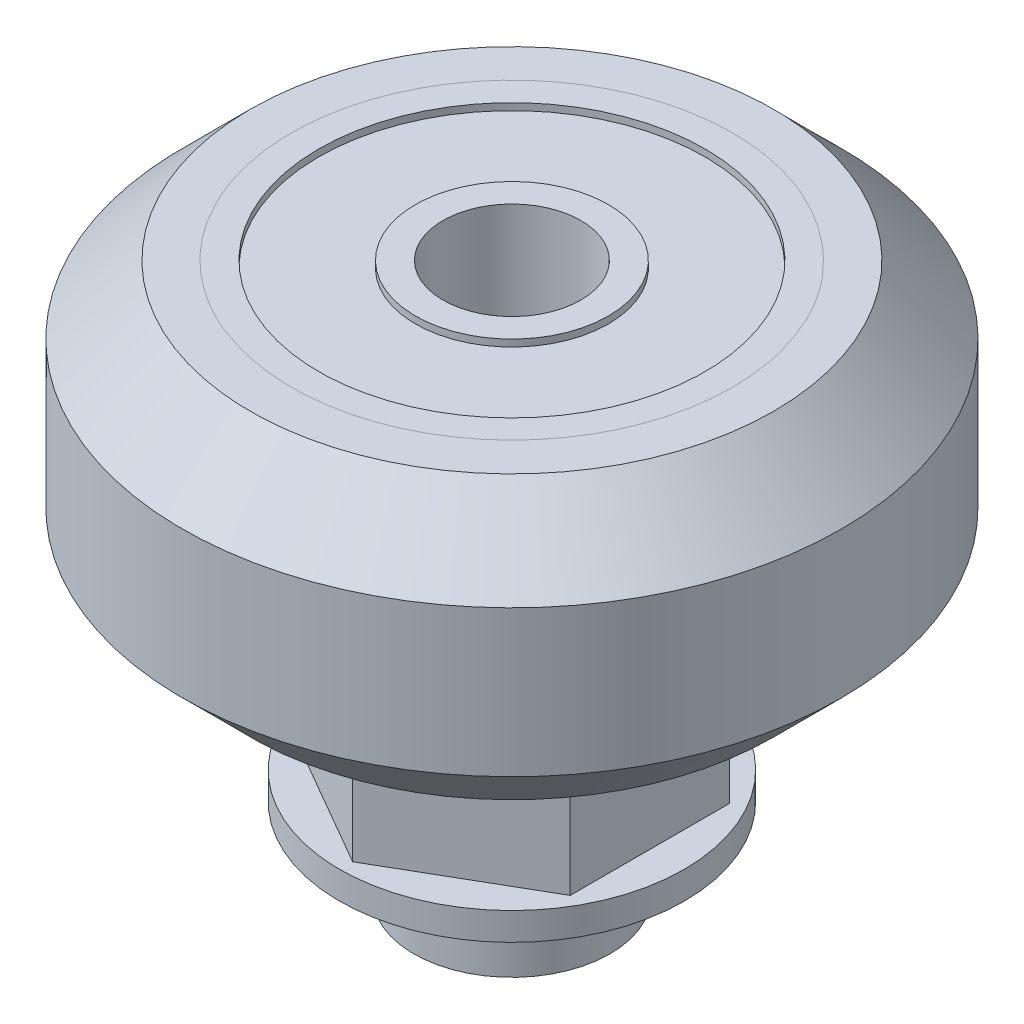
ISO-10303-21;
HEADER;
FILE_DESCRIPTION(('STEP AP214'),'2;1');
FILE_NAME('part.step','',(''),(''),'','','');
FILE_SCHEMA(('AUTOMOTIVE_DESIGN { 1 0 10303 214 1 1 1 1 }'));
ENDSEC;
DATA;
#1=APPLICATION_CONTEXT('core data for automotive mechanical design processes');
#2=APPLICATION_PROTOCOL_DEFINITION('international standard','automotive_design',2000,#1);
#3=PRODUCT_CONTEXT('',#1,'mechanical');
#4=PRODUCT('Part','Part','',(#3));
#5=PRODUCT_RELATED_PRODUCT_CATEGORY('part','',(#4));
#6=PRODUCT_DEFINITION_FORMATION('','',#4);
#7=PRODUCT_DEFINITION_CONTEXT('part definition',#1,'design');
#8=PRODUCT_DEFINITION('design','',#6,#7);
#9=PRODUCT_DEFINITION_SHAPE('','',#8);
#10=(LENGTH_UNIT() NAMED_UNIT(*) SI_UNIT(.MILLI.,.METRE.));
#11=(NAMED_UNIT(*) PLANE_ANGLE_UNIT() SI_UNIT($,.RADIAN.));
#12=(NAMED_UNIT(*) SI_UNIT($,.STERADIAN.) SOLID_ANGLE_UNIT());
#13=UNCERTAINTY_MEASURE_WITH_UNIT(LENGTH_MEASURE(1.E-05),#10,'distance_accuracy_value','');
#14=(GEOMETRIC_REPRESENTATION_CONTEXT(3) GLOBAL_UNCERTAINTY_ASSIGNED_CONTEXT((#13)) GLOBAL_UNIT_ASSIGNED_CONTEXT((#10,
#11,#12)) REPRESENTATION_CONTEXT('',''));
#15=CARTESIAN_POINT('',(0.,0.,0.));
#16=DIRECTION('',(0.,0.,1.));
#17=DIRECTION('',(1.,0.,0.));
#18=AXIS2_PLACEMENT_3D('',#15,#16,#17);
#19=CARTESIAN_POINT('',(-15.269501468331,-5.671026253248,2.998759293101));
#20=DIRECTION('',(0.,1.,0.));
#21=DIRECTION('',(-1.,0.,0.));
#22=AXIS2_PLACEMENT_3D('',#19,#20,#21);
#23=CYLINDRICAL_SURFACE('',#22,2.5);
#24=CARTESIAN_POINT('',(-15.269501468331,-6.671026253248,2.998759293101));
#25=DIRECTION('',(0.,1.,0.));
#26=DIRECTION('',(-1.,0.,0.));
#27=AXIS2_PLACEMENT_3D('',#24,#25,#26);
#28=CIRCLE('',#27,2.5);
#29=CARTESIAN_POINT('',(-12.769501468331,-6.671026253248,2.998759293101));
#30=VERTEX_POINT('',#29);
#31=EDGE_CURVE('P0_E31',#30,#30,#28,.T.);
#32=ORIENTED_EDGE('',*,*,#31,.F.);
#33=EDGE_LOOP('',(#32));
#34=FACE_BOUND('',#33,.T.);
#35=CARTESIAN_POINT('',(-15.269501468331,-5.671026253248,2.998759293101));
#36=DIRECTION('',(0.,-1.,0.));
#37=DIRECTION('',(-1.,0.,0.));
#38=AXIS2_PLACEMENT_3D('',#35,#36,#37);
#39=CIRCLE('',#38,2.5);
#40=CARTESIAN_POINT('',(-12.769501468331,-5.671026253248,2.998759293101));
#41=VERTEX_POINT('',#40);
#42=EDGE_CURVE('P0_E10',#41,#41,#39,.T.);
#43=ORIENTED_EDGE('',*,*,#42,.F.);
#44=EDGE_LOOP('',(#43));
#45=FACE_BOUND('',#44,.T.);
#46=ADVANCED_FACE('P0_F16',(#34,#45),#23,.F.);
#47=CARTESIAN_POINT('',(-15.269501468331,-5.671026253248,2.998759293101));
#48=DIRECTION('',(0.,1.,0.));
#49=DIRECTION('',(-1.,0.,0.));
#50=AXIS2_PLACEMENT_3D('',#47,#48,#49);
#51=CYLINDRICAL_SURFACE('',#50,5.);
#52=CARTESIAN_POINT('',(-15.269501468331,-6.671026253248,2.998759293101));
#53=DIRECTION('',(0.,-1.,0.));
#54=DIRECTION('',(-1.,0.,0.));
#55=AXIS2_PLACEMENT_3D('',#52,#53,#54);
#56=CIRCLE('',#55,5.);
#57=CARTESIAN_POINT('',(-10.269501468331,-6.671026253248,2.998759293101));
#58=VERTEX_POINT('',#57);
#59=EDGE_CURVE('P0_E38',#58,#58,#56,.T.);
#60=ORIENTED_EDGE('',*,*,#59,.F.);
#61=EDGE_LOOP('',(#60));
#62=FACE_BOUND('',#61,.T.);
#63=CARTESIAN_POINT('',(-15.269501468331,-5.671026253248,2.998759293101));
#64=DIRECTION('',(0.,1.,0.));
#65=DIRECTION('',(-1.,0.,0.));
#66=AXIS2_PLACEMENT_3D('',#63,#64,#65);
#67=CIRCLE('',#66,5.);
#68=CARTESIAN_POINT('',(-10.269501468331,-5.671026253248,2.998759293101));
#69=VERTEX_POINT('',#68);
#70=EDGE_CURVE('P0_E25',#69,#69,#67,.T.);
#71=ORIENTED_EDGE('',*,*,#70,.F.);
#72=EDGE_LOOP('',(#71));
#73=FACE_BOUND('',#72,.T.);
#74=ADVANCED_FACE('P0_F42',(#62,#73),#51,.T.);
#75=CARTESIAN_POINT('',(-15.269501468331,-5.671026253248,2.998759293101));
#76=DIRECTION('',(0.,-1.,0.));
#77=DIRECTION('',(1.,0.,0.));
#78=AXIS2_PLACEMENT_3D('',#75,#76,#77);
#79=PLANE('',#78);
#80=ORIENTED_EDGE('',*,*,#42,.T.);
#81=EDGE_LOOP('',(#80));
#82=FACE_BOUND('',#81,.T.);
#83=ORIENTED_EDGE('',*,*,#70,.T.);
#84=EDGE_LOOP('',(#83));
#85=FACE_BOUND('',#84,.T.);
#86=ADVANCED_FACE('P0_F18',(#82,#85),#79,.F.);
#87=CARTESIAN_POINT('',(-15.269501468331,-6.671026253248,2.998759293101));
#88=DIRECTION('',(0.,-1.,0.));
#89=DIRECTION('',(1.,0.,0.));
#90=AXIS2_PLACEMENT_3D('',#87,#88,#89);
#91=PLANE('',#90);
#92=ORIENTED_EDGE('',*,*,#31,.T.);
#93=EDGE_LOOP('',(#92));
#94=FACE_BOUND('',#93,.T.);
#95=ORIENTED_EDGE('',*,*,#59,.T.);
#96=EDGE_LOOP('',(#95));
#97=FACE_BOUND('',#96,.T.);
#98=ADVANCED_FACE('P0_F47',(#94,#97),#91,.T.);
#99=CLOSED_SHELL('',(#46,#74,#86,#98));
#100=MANIFOLD_SOLID_BREP('P0_B1',#99);
#101=CARTESIAN_POINT('',(-15.269501468331,-13.5785410381496,3.11748499511642));
#102=DIRECTION('',(0.,-1.,0.));
#103=DIRECTION('',(1.,0.,0.));
#104=AXIS2_PLACEMENT_3D('',#101,#102,#103);
#105=SPHERICAL_SURFACE('',#104,8.45948329059345);
#106=CARTESIAN_POINT('',(-17.8209112053447,-13.5785410381496,-1.30168630031734));
#107=DIRECTION('',(-0.5,0.,-0.866025403784439));
#108=DIRECTION('',(0.,-1.,0.));
#109=AXIS2_PLACEMENT_3D('',#106,#107,#108);
#110=CIRCLE('',#109,6.74715428601686);
#111=CARTESIAN_POINT('',(-20.269501468331,-7.45237051669053,0.11200794715287));
#112=VERTEX_POINT('',#111);
#113=CARTESIAN_POINT('',(-15.269501468331,-7.50857381436571,-2.77474339879526));
#114=VERTEX_POINT('',#113);
#115=EDGE_CURVE('P1_E36',#112,#114,#110,.T.);
#116=ORIENTED_EDGE('',*,*,#115,.F.);
#117=CARTESIAN_POINT('',(-20.269501468331,-13.5785410381496,3.11748499511642));
#118=DIRECTION('',(-1.,0.,0.));
#119=DIRECTION('',(0.,1.,0.));
#120=AXIS2_PLACEMENT_3D('',#117,#118,#119);
#121=CIRCLE('',#120,6.82369823071257);
#122=CARTESIAN_POINT('',(-20.269501468331,-7.34148311166209,5.88551063904913));
#123=VERTEX_POINT('',#122);
#124=EDGE_CURVE('P1_E119',#123,#112,#121,.T.);
#125=ORIENTED_EDGE('',*,*,#124,.F.);
#126=CARTESIAN_POINT('',(-17.7180917313173,-13.5785410381496,7.35856773752704));
#127=DIRECTION('',(-0.5,0.,0.866025403784439));
#128=DIRECTION('',(0.,1.,0.));
#129=AXIS2_PLACEMENT_3D('',#126,#127,#128);
#130=CIRCLE('',#129,6.89786056976115);
#131=CARTESIAN_POINT('',(-15.269501468331,-7.28677222973459,8.77226198499726));
#132=VERTEX_POINT('',#131);
#133=EDGE_CURVE('P1_E90',#132,#123,#130,.T.);
#134=ORIENTED_EDGE('',*,*,#133,.F.);
#135=CARTESIAN_POINT('',(-12.8209112053447,-13.5785410381496,7.35856773752705));
#136=DIRECTION('',(0.5,0.,0.866025403784439));
#137=DIRECTION('',(0.,1.,0.));
#138=AXIS2_PLACEMENT_3D('',#135,#136,#137);
#139=CIRCLE('',#138,6.89786056976114);
#140=CARTESIAN_POINT('',(-10.269501468331,-7.34148311166209,5.88551063904912));
#141=VERTEX_POINT('',#140);
#142=EDGE_CURVE('P1_E11',#141,#132,#139,.T.);
#143=ORIENTED_EDGE('',*,*,#142,.F.);
#144=CARTESIAN_POINT('',(-10.269501468331,-13.5785410381496,3.11748499511642));
#145=DIRECTION('',(1.,0.,0.));
#146=DIRECTION('',(0.,-1.,0.));
#147=AXIS2_PLACEMENT_3D('',#144,#145,#146);
#148=CIRCLE('',#147,6.82369823071257);
#149=CARTESIAN_POINT('',(-10.269501468331,-7.45237051669054,0.11200794715287));
#150=VERTEX_POINT('',#149);
#151=EDGE_CURVE('P1_E93',#150,#141,#148,.T.);
#152=ORIENTED_EDGE('',*,*,#151,.F.);
#153=CARTESIAN_POINT('',(-12.7180917313173,-13.5785410381496,-1.30168630031734));
#154=DIRECTION('',(0.5,0.,-0.866025403784439));
#155=DIRECTION('',(0.,-1.,0.));
#156=AXIS2_PLACEMENT_3D('',#153,#154,#155);
#157=CIRCLE('',#156,6.74715428601685);
#158=EDGE_CURVE('P1_E103',#114,#150,#157,.T.);
#159=ORIENTED_EDGE('',*,*,#158,.F.);
#160=EDGE_LOOP('',(#116,#125,#134,#143,#152,#159));
#161=FACE_BOUND('',#160,.T.);
#162=CARTESIAN_POINT('',(-15.269501468331,-6.671026253248,3.11748499511642));
#163=DIRECTION('',(0.,1.,0.));
#164=DIRECTION('',(0.,0.,-1.));
#165=AXIS2_PLACEMENT_3D('',#162,#163,#164);
#166=CIRCLE('',#165,4.88355373065512);
#167=CARTESIAN_POINT('',(-15.269501468331,-6.671026253248,8.00103872577154));
#168=VERTEX_POINT('',#167);
#169=EDGE_CURVE('P1_E127',#168,#168,#166,.T.);
#170=ORIENTED_EDGE('',*,*,#169,.F.);
#171=EDGE_LOOP('',(#170));
#172=FACE_BOUND('',#171,.T.);
#173=ADVANCED_FACE('P1_F17',(#161,#172),#105,.T.);
#174=CARTESIAN_POINT('',(-10.269501468331,-6.671026253248,5.88551063904912));
#175=DIRECTION('',(0.5,0.,0.866025403784439));
#176=DIRECTION('',(-0.866025403784439,0.,0.5));
#177=AXIS2_PLACEMENT_3D('',#174,#175,#176);
#178=PLANE('',#177);
#179=ORIENTED_EDGE('',*,*,#142,.T.);
#180=DIRECTION('',(0.,-1.,0.));
#181=VECTOR('',#180,1.);
#182=CARTESIAN_POINT('',(-15.269501468331,-6.671026253248,8.77226198499726));
#183=LINE('',#182,#181);
#184=CARTESIAN_POINT('',(-15.269501468331,-11.671026253248,8.77226198499726));
#185=VERTEX_POINT('',#184);
#186=EDGE_CURVE('P1_E27',#132,#185,#183,.T.);
#187=ORIENTED_EDGE('',*,*,#186,.T.);
#188=DIRECTION('',(-0.866025403784439,0.,0.5));
#189=VECTOR('',#188,1.);
#190=CARTESIAN_POINT('',(-15.269501468331,-11.671026253248,8.77226198499726));
#191=LINE('',#190,#189);
#192=CARTESIAN_POINT('',(-10.269501468331,-11.671026253248,5.88551063904912));
#193=VERTEX_POINT('',#192);
#194=EDGE_CURVE('P1_E71',#193,#185,#191,.T.);
#195=ORIENTED_EDGE('',*,*,#194,.F.);
#196=DIRECTION('',(0.,-1.,0.));
#197=VECTOR('',#196,1.);
#198=CARTESIAN_POINT('',(-10.269501468331,-6.671026253248,5.88551063904912));
#199=LINE('',#198,#197);
#200=EDGE_CURVE('P1_E80',#141,#193,#199,.T.);
#201=ORIENTED_EDGE('',*,*,#200,.F.);
#202=EDGE_LOOP('',(#179,#187,#195,#201));
#203=FACE_BOUND('',#202,.T.);
#204=ADVANCED_FACE('P1_F102',(#203),#178,.T.);
#205=CARTESIAN_POINT('',(-15.269501468331,-6.671026253248,8.77226198499726));
#206=DIRECTION('',(-0.5,0.,0.866025403784439));
#207=DIRECTION('',(-0.866025403784439,0.,-0.5));
#208=AXIS2_PLACEMENT_3D('',#205,#206,#207);
#209=PLANE('',#208);
#210=ORIENTED_EDGE('',*,*,#133,.T.);
#211=DIRECTION('',(0.,-1.,0.));
#212=VECTOR('',#211,1.);
#213=CARTESIAN_POINT('',(-20.269501468331,-6.671026253248,5.88551063904913));
#214=LINE('',#213,#212);
#215=CARTESIAN_POINT('',(-20.269501468331,-11.671026253248,5.88551063904913));
#216=VERTEX_POINT('',#215);
#217=EDGE_CURVE('P1_E125',#123,#216,#214,.T.);
#218=ORIENTED_EDGE('',*,*,#217,.T.);
#219=DIRECTION('',(-0.866025403784439,0.,-0.5));
#220=VECTOR('',#219,1.);
#221=CARTESIAN_POINT('',(-20.269501468331,-11.671026253248,5.88551063904913));
#222=LINE('',#221,#220);
#223=EDGE_CURVE('P1_E110',#185,#216,#222,.T.);
#224=ORIENTED_EDGE('',*,*,#223,.F.);
#225=ORIENTED_EDGE('',*,*,#186,.F.);
#226=EDGE_LOOP('',(#210,#218,#224,#225));
#227=FACE_BOUND('',#226,.T.);
#228=ADVANCED_FACE('P1_F152',(#227),#209,.T.);
#229=CARTESIAN_POINT('',(-20.269501468331,-6.671026253248,5.88551063904913));
#230=DIRECTION('',(-1.,0.,0.));
#231=DIRECTION('',(0.,0.,-1.));
#232=AXIS2_PLACEMENT_3D('',#229,#230,#231);
#233=PLANE('',#232);
#234=ORIENTED_EDGE('',*,*,#124,.T.);
#235=DIRECTION('',(0.,-1.,0.));
#236=VECTOR('',#235,1.);
#237=CARTESIAN_POINT('',(-20.269501468331,-6.671026253248,0.11200794715287));
#238=LINE('',#237,#236);
#239=CARTESIAN_POINT('',(-20.269501468331,-11.671026253248,0.11200794715287));
#240=VERTEX_POINT('',#239);
#241=EDGE_CURVE('P1_E116',#112,#240,#238,.T.);
#242=ORIENTED_EDGE('',*,*,#241,.T.);
#243=DIRECTION('',(0.,0.,-1.));
#244=VECTOR('',#243,1.);
#245=CARTESIAN_POINT('',(-20.269501468331,-11.671026253248,0.11200794715287));
#246=LINE('',#245,#244);
#247=EDGE_CURVE('P1_E112',#216,#240,#246,.T.);
#248=ORIENTED_EDGE('',*,*,#247,.F.);
#249=ORIENTED_EDGE('',*,*,#217,.F.);
#250=EDGE_LOOP('',(#234,#242,#248,#249));
#251=FACE_BOUND('',#250,.T.);
#252=ADVANCED_FACE('P1_F154',(#251),#233,.T.);
#253=CARTESIAN_POINT('',(-15.269501468331,-15.671026253248,2.998759293101));
#254=DIRECTION('',(0.,-1.,0.));
#255=DIRECTION('',(-1.,0.,0.));
#256=AXIS2_PLACEMENT_3D('',#253,#254,#255);
#257=CYLINDRICAL_SURFACE('',#256,2.5);
#258=CARTESIAN_POINT('',(-15.269501468331,-6.671026253248,2.998759293101));
#259=DIRECTION('',(0.,-1.,0.));
#260=DIRECTION('',(-1.,0.,0.));
#261=AXIS2_PLACEMENT_3D('',#258,#259,#260);
#262=CIRCLE('',#261,2.5);
#263=CARTESIAN_POINT('',(-12.769501468331,-6.671026253248,2.998759293101));
#264=VERTEX_POINT('',#263);
#265=EDGE_CURVE('P1_E130',#264,#264,#262,.T.);
#266=ORIENTED_EDGE('',*,*,#265,.F.);
#267=EDGE_LOOP('',(#266));
#268=FACE_BOUND('',#267,.T.);
#269=CARTESIAN_POINT('',(-15.269501468331,-15.671026253248,2.998759293101));
#270=DIRECTION('',(0.,1.,0.));
#271=DIRECTION('',(-1.,0.,0.));
#272=AXIS2_PLACEMENT_3D('',#269,#270,#271);
#273=CIRCLE('',#272,2.5);
#274=CARTESIAN_POINT('',(-12.769501468331,-15.671026253248,2.998759293101));
#275=VERTEX_POINT('',#274);
#276=EDGE_CURVE('P1_E120',#275,#275,#273,.T.);
#277=ORIENTED_EDGE('',*,*,#276,.F.);
#278=EDGE_LOOP('',(#277));
#279=FACE_BOUND('',#278,.T.);
#280=ADVANCED_FACE('P1_F163',(#268,#279),#257,.F.);
#281=CARTESIAN_POINT('',(-15.269501468331,-12.671026253248,2.998759293101));
#282=DIRECTION('',(0.,1.,0.));
#283=DIRECTION('',(-1.,0.,0.));
#284=AXIS2_PLACEMENT_3D('',#281,#282,#283);
#285=CYLINDRICAL_SURFACE('',#284,3.56);
#286=CARTESIAN_POINT('',(-15.269501468331,-15.671026253248,2.998759293101));
#287=DIRECTION('',(0.,-1.,0.));
#288=DIRECTION('',(-1.,0.,0.));
#289=AXIS2_PLACEMENT_3D('',#286,#287,#288);
#290=CIRCLE('',#289,3.56);
#291=CARTESIAN_POINT('',(-11.709501468331,-15.671026253248,2.998759293101));
#292=VERTEX_POINT('',#291);
#293=EDGE_CURVE('P1_E134',#292,#292,#290,.T.);
#294=ORIENTED_EDGE('',*,*,#293,.F.);
#295=EDGE_LOOP('',(#294));
#296=FACE_BOUND('',#295,.T.);
#297=CARTESIAN_POINT('',(-15.269501468331,-12.671026253248,2.998759293101));
#298=DIRECTION('',(0.,1.,0.));
#299=DIRECTION('',(-1.,0.,0.));
#300=AXIS2_PLACEMENT_3D('',#297,#298,#299);
#301=CIRCLE('',#300,3.56);
#302=CARTESIAN_POINT('',(-11.709501468331,-12.671026253248,2.998759293101));
#303=VERTEX_POINT('',#302);
#304=EDGE_CURVE('P1_E142',#303,#303,#301,.T.);
#305=ORIENTED_EDGE('',*,*,#304,.F.);
#306=EDGE_LOOP('',(#305));
#307=FACE_BOUND('',#306,.T.);
#308=ADVANCED_FACE('P1_F166',(#296,#307),#285,.T.);
#309=CARTESIAN_POINT('',(-15.269501468331,-15.671026253248,2.998759293101));
#310=DIRECTION('',(0.,-1.,0.));
#311=DIRECTION('',(1.,0.,0.));
#312=AXIS2_PLACEMENT_3D('',#309,#310,#311);
#313=PLANE('',#312);
#314=ORIENTED_EDGE('',*,*,#276,.T.);
#315=EDGE_LOOP('',(#314));
#316=FACE_BOUND('',#315,.T.);
#317=ORIENTED_EDGE('',*,*,#293,.T.);
#318=EDGE_LOOP('',(#317));
#319=FACE_BOUND('',#318,.T.);
#320=ADVANCED_FACE('P1_F170',(#316,#319),#313,.T.);
#321=CARTESIAN_POINT('',(-15.269501468331,-11.671026253248,2.998759293101));
#322=DIRECTION('',(0.,-1.,0.));
#323=DIRECTION('',(1.,0.,0.));
#324=AXIS2_PLACEMENT_3D('',#321,#322,#323);
#325=PLANE('',#324);
#326=CARTESIAN_POINT('',(-15.269501468331,-11.671026253248,2.998759293101));
#327=DIRECTION('',(0.,1.,0.));
#328=DIRECTION('',(-1.,0.,0.));
#329=AXIS2_PLACEMENT_3D('',#326,#327,#328);
#330=CIRCLE('',#329,6.25);
#331=CARTESIAN_POINT('',(-9.019501468331,-11.671026253248,2.998759293101));
#332=VERTEX_POINT('',#331);
#333=EDGE_CURVE('P1_E131',#332,#332,#330,.T.);
#334=ORIENTED_EDGE('',*,*,#333,.T.);
#335=EDGE_LOOP('',(#334));
#336=FACE_BOUND('',#335,.T.);
#337=DIRECTION('',(0.866025403784439,0.,-0.5));
#338=VECTOR('',#337,1.);
#339=CARTESIAN_POINT('',(-15.269501468331,-11.671026253248,-2.77474339879526));
#340=LINE('',#339,#338);
#341=CARTESIAN_POINT('',(-15.269501468331,-11.671026253248,-2.77474339879526));
#342=VERTEX_POINT('',#341);
#343=EDGE_CURVE('P1_E21',#240,#342,#340,.T.);
#344=ORIENTED_EDGE('',*,*,#343,.T.);
#345=DIRECTION('',(0.866025403784439,0.,0.5));
#346=VECTOR('',#345,1.);
#347=CARTESIAN_POINT('',(-10.269501468331,-11.671026253248,0.11200794715287));
#348=LINE('',#347,#346);
#349=CARTESIAN_POINT('',(-10.269501468331,-11.671026253248,0.11200794715287));
#350=VERTEX_POINT('',#349);
#351=EDGE_CURVE('P1_E113',#342,#350,#348,.T.);
#352=ORIENTED_EDGE('',*,*,#351,.T.);
#353=DIRECTION('',(0.,0.,1.));
#354=VECTOR('',#353,1.);
#355=CARTESIAN_POINT('',(-10.269501468331,-11.671026253248,5.88551063904912));
#356=LINE('',#355,#354);
#357=EDGE_CURVE('P1_E108',#350,#193,#356,.T.);
#358=ORIENTED_EDGE('',*,*,#357,.T.);
#359=ORIENTED_EDGE('',*,*,#194,.T.);
#360=ORIENTED_EDGE('',*,*,#223,.T.);
#361=ORIENTED_EDGE('',*,*,#247,.T.);
#362=EDGE_LOOP('',(#344,#352,#358,#359,#360,#361));
#363=FACE_BOUND('',#362,.T.);
#364=ADVANCED_FACE('P1_F173',(#336,#363),#325,.F.);
#365=CARTESIAN_POINT('',(-15.269501468331,-11.671026253248,2.998759293101));
#366=DIRECTION('',(0.,1.,0.));
#367=DIRECTION('',(-1.,0.,0.));
#368=AXIS2_PLACEMENT_3D('',#365,#366,#367);
#369=CYLINDRICAL_SURFACE('',#368,6.25);
#370=CARTESIAN_POINT('',(-15.269501468331,-12.671026253248,2.998759293101));
#371=DIRECTION('',(0.,-1.,0.));
#372=DIRECTION('',(-1.,0.,0.));
#373=AXIS2_PLACEMENT_3D('',#370,#371,#372);
#374=CIRCLE('',#373,6.25);
#375=CARTESIAN_POINT('',(-9.019501468331,-12.671026253248,2.998759293101));
#376=VERTEX_POINT('',#375);
#377=EDGE_CURVE('P1_E135',#376,#376,#374,.T.);
#378=ORIENTED_EDGE('',*,*,#377,.F.);
#379=EDGE_LOOP('',(#378));
#380=FACE_BOUND('',#379,.T.);
#381=ORIENTED_EDGE('',*,*,#333,.F.);
#382=EDGE_LOOP('',(#381));
#383=FACE_BOUND('',#382,.T.);
#384=ADVANCED_FACE('P1_F183',(#380,#383),#369,.T.);
#385=CARTESIAN_POINT('',(-15.269501468331,-12.671026253248,2.998759293101));
#386=DIRECTION('',(0.,-1.,0.));
#387=DIRECTION('',(1.,0.,0.));
#388=AXIS2_PLACEMENT_3D('',#385,#386,#387);
#389=PLANE('',#388);
#390=ORIENTED_EDGE('',*,*,#304,.T.);
#391=EDGE_LOOP('',(#390));
#392=FACE_BOUND('',#391,.T.);
#393=ORIENTED_EDGE('',*,*,#377,.T.);
#394=EDGE_LOOP('',(#393));
#395=FACE_BOUND('',#394,.T.);
#396=ADVANCED_FACE('P1_F180',(#392,#395),#389,.T.);
#397=CARTESIAN_POINT('',(-20.269501468331,-6.671026253248,0.11200794715287));
#398=DIRECTION('',(-0.5,0.,-0.866025403784439));
#399=DIRECTION('',(0.866025403784439,0.,-0.5));
#400=AXIS2_PLACEMENT_3D('',#397,#398,#399);
#401=PLANE('',#400);
#402=ORIENTED_EDGE('',*,*,#115,.T.);
#403=DIRECTION('',(0.,-1.,0.));
#404=VECTOR('',#403,1.);
#405=CARTESIAN_POINT('',(-15.269501468331,-6.671026253248,-2.77474339879526));
#406=LINE('',#405,#404);
#407=EDGE_CURVE('P1_E97',#114,#342,#406,.T.);
#408=ORIENTED_EDGE('',*,*,#407,.T.);
#409=ORIENTED_EDGE('',*,*,#343,.F.);
#410=ORIENTED_EDGE('',*,*,#241,.F.);
#411=EDGE_LOOP('',(#402,#408,#409,#410));
#412=FACE_BOUND('',#411,.T.);
#413=ADVANCED_FACE('P1_F19',(#412),#401,.T.);
#414=CARTESIAN_POINT('',(-10.269501468331,-6.671026253248,0.11200794715287));
#415=DIRECTION('',(1.,0.,0.));
#416=DIRECTION('',(0.,0.,1.));
#417=AXIS2_PLACEMENT_3D('',#414,#415,#416);
#418=PLANE('',#417);
#419=ORIENTED_EDGE('',*,*,#151,.T.);
#420=ORIENTED_EDGE('',*,*,#200,.T.);
#421=ORIENTED_EDGE('',*,*,#357,.F.);
#422=DIRECTION('',(0.,-1.,0.));
#423=VECTOR('',#422,1.);
#424=CARTESIAN_POINT('',(-10.269501468331,-6.671026253248,0.11200794715287));
#425=LINE('',#424,#423);
#426=EDGE_CURVE('P1_E96',#150,#350,#425,.T.);
#427=ORIENTED_EDGE('',*,*,#426,.F.);
#428=EDGE_LOOP('',(#419,#420,#421,#427));
#429=FACE_BOUND('',#428,.T.);
#430=ADVANCED_FACE('P1_F94',(#429),#418,.T.);
#431=CARTESIAN_POINT('',(-15.269501468331,-6.671026253248,-2.77474339879526));
#432=DIRECTION('',(0.5,0.,-0.866025403784439));
#433=DIRECTION('',(0.866025403784439,0.,0.5));
#434=AXIS2_PLACEMENT_3D('',#431,#432,#433);
#435=PLANE('',#434);
#436=ORIENTED_EDGE('',*,*,#158,.T.);
#437=ORIENTED_EDGE('',*,*,#426,.T.);
#438=ORIENTED_EDGE('',*,*,#351,.F.);
#439=ORIENTED_EDGE('',*,*,#407,.F.);
#440=EDGE_LOOP('',(#436,#437,#438,#439));
#441=FACE_BOUND('',#440,.T.);
#442=ADVANCED_FACE('P1_F198',(#441),#435,.T.);
#443=CARTESIAN_POINT('',(-15.269501468331,-6.671026253248,2.998759293101));
#444=DIRECTION('',(0.,-1.,0.));
#445=DIRECTION('',(1.,0.,0.));
#446=AXIS2_PLACEMENT_3D('',#443,#444,#445);
#447=PLANE('',#446);
#448=ORIENTED_EDGE('',*,*,#169,.T.);
#449=EDGE_LOOP('',(#448));
#450=FACE_BOUND('',#449,.T.);
#451=ORIENTED_EDGE('',*,*,#265,.T.);
#452=EDGE_LOOP('',(#451));
#453=FACE_BOUND('',#452,.T.);
#454=ADVANCED_FACE('P1_F161',(#450,#453),#447,.F.);
#455=CLOSED_SHELL('',(#173,#204,#228,#252,#280,#308,#320,#364,#384,#396,#413,#430,#442,#454));
#456=MANIFOLD_SOLID_BREP('P1_B1',#455);
#457=CARTESIAN_POINT('',(-15.269501468331,-0.786026253248,2.998759293101));
#458=DIRECTION('',(0.,1.,0.));
#459=DIRECTION('',(1.,0.,0.));
#460=AXIS2_PLACEMENT_3D('',#457,#458,#459);
#461=CYLINDRICAL_SURFACE('',#460,7.987);
#462=CARTESIAN_POINT('',(-15.269501468331,-5.901026253248,2.998759293101));
#463=DIRECTION('',(0.,-1.,0.));
#464=DIRECTION('',(1.,0.,0.));
#465=AXIS2_PLACEMENT_3D('',#462,#463,#464);
#466=CIRCLE('',#465,7.987);
#467=CARTESIAN_POINT('',(-7.282501468331,-5.901026253248,2.998759293101));
#468=VERTEX_POINT('',#467);
#469=EDGE_CURVE('P2_E11',#468,#468,#466,.T.);
#470=ORIENTED_EDGE('',*,*,#469,.T.);
#471=EDGE_LOOP('',(#470));
#472=FACE_BOUND('',#471,.T.);
#473=CARTESIAN_POINT('',(-15.269501468331,4.328973746752,2.998759293101));
#474=DIRECTION('',(0.,-1.,0.));
#475=DIRECTION('',(1.,0.,0.));
#476=AXIS2_PLACEMENT_3D('',#473,#474,#475);
#477=CIRCLE('',#476,7.987);
#478=CARTESIAN_POINT('',(-7.282501468331,4.328973746752,2.998759293101));
#479=VERTEX_POINT('',#478);
#480=EDGE_CURVE('P2_E27',#479,#479,#477,.T.);
#481=ORIENTED_EDGE('',*,*,#480,.F.);
#482=EDGE_LOOP('',(#481));
#483=FACE_BOUND('',#482,.T.);
#484=ADVANCED_FACE('P2_F17',(#472,#483),#461,.F.);
#485=CARTESIAN_POINT('',(-5.782501468331,4.328973746752,2.998759293101));
#486=DIRECTION('',(0.,1.,0.));
#487=DIRECTION('',(0.,0.,1.));
#488=AXIS2_PLACEMENT_3D('',#485,#486,#487);
#489=PLANE('',#488);
#490=ORIENTED_EDGE('',*,*,#480,.T.);
#491=EDGE_LOOP('',(#490));
#492=FACE_BOUND('',#491,.T.);
#493=CARTESIAN_POINT('',(-15.269501468331,4.328973746752,2.998759293101));
#494=DIRECTION('',(0.,-1.,0.));
#495=DIRECTION('',(1.,0.,0.));
#496=AXIS2_PLACEMENT_3D('',#493,#494,#495);
#497=CIRCLE('',#496,9.487);
#498=CARTESIAN_POINT('',(-5.782501468331,4.328973746752,2.998759293101));
#499=VERTEX_POINT('',#498);
#500=EDGE_CURVE('P2_E50',#499,#499,#497,.T.);
#501=ORIENTED_EDGE('',*,*,#500,.F.);
#502=EDGE_LOOP('',(#501));
#503=FACE_BOUND('',#502,.T.);
#504=ADVANCED_FACE('P2_F61',(#492,#503),#489,.T.);
#505=CARTESIAN_POINT('',(-15.269501468331,3.097473746752,2.998759293101));
#506=DIRECTION('',(0.,-1.,0.));
#507=DIRECTION('',(1.,0.,0.));
#508=AXIS2_PLACEMENT_3D('',#505,#506,#507);
#509=CONICAL_SURFACE('',#508,10.7185,0.785398163397448);
#510=ORIENTED_EDGE('',*,*,#500,.T.);
#511=EDGE_LOOP('',(#510));
#512=FACE_BOUND('',#511,.T.);
#513=CARTESIAN_POINT('',(-15.269501468331,1.865973746752,2.998759293101));
#514=DIRECTION('',(0.,-1.,0.));
#515=DIRECTION('',(1.,0.,0.));
#516=AXIS2_PLACEMENT_3D('',#513,#514,#515);
#517=CIRCLE('',#516,11.95);
#518=CARTESIAN_POINT('',(-3.319501468331,1.865973746752,2.998759293101));
#519=VERTEX_POINT('',#518);
#520=EDGE_CURVE('P2_E48',#519,#519,#517,.T.);
#521=ORIENTED_EDGE('',*,*,#520,.F.);
#522=EDGE_LOOP('',(#521));
#523=FACE_BOUND('',#522,.T.);
#524=ADVANCED_FACE('P2_F19',(#512,#523),#509,.T.);
#525=CARTESIAN_POINT('',(-15.269501468331,-0.786026253248,2.998759293101));
#526=DIRECTION('',(0.,1.,0.));
#527=DIRECTION('',(1.,0.,0.));
#528=AXIS2_PLACEMENT_3D('',#525,#526,#527);
#529=CYLINDRICAL_SURFACE('',#528,11.95);
#530=ORIENTED_EDGE('',*,*,#520,.T.);
#531=EDGE_LOOP('',(#530));
#532=FACE_BOUND('',#531,.T.);
#533=CARTESIAN_POINT('',(-15.269501468331,-3.438026253248,2.998759293101));
#534=DIRECTION('',(0.,-1.,0.));
#535=DIRECTION('',(1.,0.,0.));
#536=AXIS2_PLACEMENT_3D('',#533,#534,#535);
#537=CIRCLE('',#536,11.95);
#538=CARTESIAN_POINT('',(-3.319501468331,-3.438026253248,2.998759293101));
#539=VERTEX_POINT('',#538);
#540=EDGE_CURVE('P2_E45',#539,#539,#537,.T.);
#541=ORIENTED_EDGE('',*,*,#540,.F.);
#542=EDGE_LOOP('',(#541));
#543=FACE_BOUND('',#542,.T.);
#544=ADVANCED_FACE('P2_F46',(#532,#543),#529,.T.);
#545=CARTESIAN_POINT('',(-15.269501468331,-4.669526253248,2.998759293101));
#546=DIRECTION('',(0.,1.,0.));
#547=DIRECTION('',(1.,0.,0.));
#548=AXIS2_PLACEMENT_3D('',#545,#546,#547);
#549=CONICAL_SURFACE('',#548,10.7185,0.785398163397448);
#550=ORIENTED_EDGE('',*,*,#540,.T.);
#551=EDGE_LOOP('',(#550));
#552=FACE_BOUND('',#551,.T.);
#553=CARTESIAN_POINT('',(-15.269501468331,-5.901026253248,2.998759293101));
#554=DIRECTION('',(0.,-1.,0.));
#555=DIRECTION('',(1.,0.,0.));
#556=AXIS2_PLACEMENT_3D('',#553,#554,#555);
#557=CIRCLE('',#556,9.487);
#558=CARTESIAN_POINT('',(-5.782501468331,-5.901026253248,2.998759293101));
#559=VERTEX_POINT('',#558);
#560=EDGE_CURVE('P2_E21',#559,#559,#557,.T.);
#561=ORIENTED_EDGE('',*,*,#560,.F.);
#562=EDGE_LOOP('',(#561));
#563=FACE_BOUND('',#562,.T.);
#564=ADVANCED_FACE('P2_F75',(#552,#563),#549,.T.);
#565=CARTESIAN_POINT('',(-7.282501468331,-5.901026253248,2.998759293101));
#566=DIRECTION('',(0.,-1.,0.));
#567=DIRECTION('',(0.,0.,-1.));
#568=AXIS2_PLACEMENT_3D('',#565,#566,#567);
#569=PLANE('',#568);
#570=ORIENTED_EDGE('',*,*,#560,.T.);
#571=EDGE_LOOP('',(#570));
#572=FACE_BOUND('',#571,.T.);
#573=ORIENTED_EDGE('',*,*,#469,.F.);
#574=EDGE_LOOP('',(#573));
#575=FACE_BOUND('',#574,.T.);
#576=ADVANCED_FACE('P2_F78',(#572,#575),#569,.T.);
#577=CLOSED_SHELL('',(#484,#504,#524,#544,#564,#576));
#578=MANIFOLD_SOLID_BREP('P2_B1',#577);
#579=CARTESIAN_POINT('',(-12.41701713586,4.328973746752,0.97062390979753));
#580=DIRECTION('',(0.,1.,0.));
#581=DIRECTION('',(0.57946725237242,0.,0.814995523563141));
#582=AXIS2_PLACEMENT_3D('',#579,#580,#581);
#583=PLANE('',#582);
#584=CARTESIAN_POINT('',(-15.269501468331,4.328973746752,2.998759293101));
#585=DIRECTION('',(0.,-1.,0.));
#586=DIRECTION('',(0.57946725237242,0.,0.814995523563141));
#587=AXIS2_PLACEMENT_3D('',#584,#585,#586);
#588=CIRCLE('',#587,3.5);
#589=CARTESIAN_POINT('',(-12.41701713586,4.328973746752,0.97062390979753));
#590=VERTEX_POINT('',#589);
#591=EDGE_CURVE('P3_E27',#590,#590,#588,.T.);
#592=ORIENTED_EDGE('',*,*,#591,.F.);
#593=EDGE_LOOP('',(#592));
#594=FACE_BOUND('',#593,.T.);
#595=CARTESIAN_POINT('',(-15.269501468331,4.328973746752,2.998759293101));
#596=DIRECTION('',(0.,-1.,0.));
#597=DIRECTION('',(0.57946725237242,0.,0.814995523563141));
#598=AXIS2_PLACEMENT_3D('',#595,#596,#597);
#599=CIRCLE('',#598,2.5);
#600=CARTESIAN_POINT('',(-13.2320126594231,4.328973746752,1.55009116216995));
#601=VERTEX_POINT('',#600);
#602=EDGE_CURVE('P3_E11',#601,#601,#599,.T.);
#603=ORIENTED_EDGE('',*,*,#602,.T.);
#604=EDGE_LOOP('',(#603));
#605=FACE_BOUND('',#604,.T.);
#606=ADVANCED_FACE('P3_F17',(#594,#605),#583,.T.);
#607=CARTESIAN_POINT('',(-15.269501468331,4.203973746752,2.998759293101));
#608=DIRECTION('',(0.,1.,0.));
#609=DIRECTION('',(0.814995523563141,0.,-0.57946725237242));
#610=AXIS2_PLACEMENT_3D('',#607,#608,#609);
#611=CYLINDRICAL_SURFACE('',#610,3.5);
#612=CARTESIAN_POINT('',(-15.269501468331,4.078973746752,2.998759293101));
#613=DIRECTION('',(0.,-1.,0.));
#614=DIRECTION('',(0.57946725237242,0.,0.814995523563141));
#615=AXIS2_PLACEMENT_3D('',#612,#613,#614);
#616=CIRCLE('',#615,3.5);
#617=CARTESIAN_POINT('',(-12.41701713586,4.078973746752,0.97062390979753));
#618=VERTEX_POINT('',#617);
#619=EDGE_CURVE('P3_E89',#618,#618,#616,.T.);
#620=ORIENTED_EDGE('',*,*,#619,.F.);
#621=EDGE_LOOP('',(#620));
#622=FACE_BOUND('',#621,.T.);
#623=ORIENTED_EDGE('',*,*,#591,.T.);
#624=EDGE_LOOP('',(#623));
#625=FACE_BOUND('',#624,.T.);
#626=ADVANCED_FACE('P3_F110',(#622,#625),#611,.T.);
#627=CARTESIAN_POINT('',(-9.56453280338901,4.078973746752,-1.05751147350594));
#628=DIRECTION('',(0.,1.,0.));
#629=DIRECTION('',(0.57946725237242,0.,0.814995523563141));
#630=AXIS2_PLACEMENT_3D('',#627,#628,#629);
#631=PLANE('',#630);
#632=CARTESIAN_POINT('',(-15.269501468331,4.078973746752,2.998759293101));
#633=DIRECTION('',(0.,-1.,0.));
#634=DIRECTION('',(0.57946725237242,0.,0.814995523563141));
#635=AXIS2_PLACEMENT_3D('',#632,#633,#634);
#636=CIRCLE('',#635,7.);
#637=CARTESIAN_POINT('',(-9.56453280338901,4.078973746752,-1.05751147350594));
#638=VERTEX_POINT('',#637);
#639=EDGE_CURVE('P3_E86',#638,#638,#636,.T.);
#640=ORIENTED_EDGE('',*,*,#639,.F.);
#641=EDGE_LOOP('',(#640));
#642=FACE_BOUND('',#641,.T.);
#643=ORIENTED_EDGE('',*,*,#619,.T.);
#644=EDGE_LOOP('',(#643));
#645=FACE_BOUND('',#644,.T.);
#646=ADVANCED_FACE('P3_F19',(#642,#645),#631,.T.);
#647=CARTESIAN_POINT('',(-15.269501468331,4.203973746752,2.998759293101));
#648=DIRECTION('',(0.,1.,0.));
#649=DIRECTION('',(0.814995523563141,0.,-0.57946725237242));
#650=AXIS2_PLACEMENT_3D('',#647,#648,#649);
#651=CYLINDRICAL_SURFACE('',#650,7.);
#652=CARTESIAN_POINT('',(-15.269501468331,4.328973746752,2.998759293101));
#653=DIRECTION('',(0.,-1.,0.));
#654=DIRECTION('',(0.57946725237242,0.,0.814995523563141));
#655=AXIS2_PLACEMENT_3D('',#652,#653,#654);
#656=CIRCLE('',#655,7.);
#657=CARTESIAN_POINT('',(-9.56453280338901,4.328973746752,-1.05751147350594));
#658=VERTEX_POINT('',#657);
#659=EDGE_CURVE('P3_E84',#658,#658,#656,.T.);
#660=ORIENTED_EDGE('',*,*,#659,.F.);
#661=EDGE_LOOP('',(#660));
#662=FACE_BOUND('',#661,.T.);
#663=ORIENTED_EDGE('',*,*,#639,.T.);
#664=EDGE_LOOP('',(#663));
#665=FACE_BOUND('',#664,.T.);
#666=ADVANCED_FACE('P3_F98',(#662,#665),#651,.F.);
#667=CARTESIAN_POINT('',(-8.74953727982587,4.328973746752,-1.63697872587836));
#668=DIRECTION('',(0.,1.,0.));
#669=DIRECTION('',(0.57946725237242,0.,0.814995523563141));
#670=AXIS2_PLACEMENT_3D('',#667,#668,#669);
#671=PLANE('',#670);
#672=CARTESIAN_POINT('',(-15.269501468331,4.328973746752,2.998759293101));
#673=DIRECTION('',(0.,-1.,0.));
#674=DIRECTION('',(0.57946725237242,0.,0.814995523563141));
#675=AXIS2_PLACEMENT_3D('',#672,#673,#674);
#676=CIRCLE('',#675,8.);
#677=CARTESIAN_POINT('',(-8.74953727982587,4.328973746752,-1.63697872587836));
#678=VERTEX_POINT('',#677);
#679=EDGE_CURVE('P3_E70',#678,#678,#676,.T.);
#680=ORIENTED_EDGE('',*,*,#679,.F.);
#681=EDGE_LOOP('',(#680));
#682=FACE_BOUND('',#681,.T.);
#683=ORIENTED_EDGE('',*,*,#659,.T.);
#684=EDGE_LOOP('',(#683));
#685=FACE_BOUND('',#684,.T.);
#686=ADVANCED_FACE('P3_F96',(#682,#685),#671,.T.);
#687=CARTESIAN_POINT('',(-15.269501468331,1.828973746752,2.998759293101));
#688=DIRECTION('',(0.,1.,0.));
#689=DIRECTION('',(0.814995523563141,0.,-0.57946725237242));
#690=AXIS2_PLACEMENT_3D('',#687,#688,#689);
#691=CYLINDRICAL_SURFACE('',#690,8.);
#692=CARTESIAN_POINT('',(-15.269501468331,-0.671026253247998,2.998759293101));
#693=DIRECTION('',(0.,-1.,0.));
#694=DIRECTION('',(0.57946725237242,0.,0.814995523563141));
#695=AXIS2_PLACEMENT_3D('',#692,#693,#694);
#696=CIRCLE('',#695,8.);
#697=CARTESIAN_POINT('',(-8.74953727982587,-0.671026253247998,-1.63697872587836));
#698=VERTEX_POINT('',#697);
#699=EDGE_CURVE('P3_E67',#698,#698,#696,.T.);
#700=ORIENTED_EDGE('',*,*,#699,.F.);
#701=EDGE_LOOP('',(#700));
#702=FACE_BOUND('',#701,.T.);
#703=ORIENTED_EDGE('',*,*,#679,.T.);
#704=EDGE_LOOP('',(#703));
#705=FACE_BOUND('',#704,.T.);
#706=ADVANCED_FACE('P3_F94',(#702,#705),#691,.T.);
#707=CARTESIAN_POINT('',(-9.56453280338901,-0.671026253247998,-1.05751147350594));
#708=DIRECTION('',(0.,-1.,0.));
#709=DIRECTION('',(-0.57946725237242,0.,-0.814995523563141));
#710=AXIS2_PLACEMENT_3D('',#707,#708,#709);
#711=PLANE('',#710);
#712=CARTESIAN_POINT('',(-15.269501468331,-0.671026253247998,2.998759293101));
#713=DIRECTION('',(0.,-1.,0.));
#714=DIRECTION('',(0.57946725237242,0.,0.814995523563141));
#715=AXIS2_PLACEMENT_3D('',#712,#713,#714);
#716=CIRCLE('',#715,7.);
#717=CARTESIAN_POINT('',(-9.56453280338901,-0.671026253247998,-1.05751147350594));
#718=VERTEX_POINT('',#717);
#719=EDGE_CURVE('P3_E21',#718,#718,#716,.T.);
#720=ORIENTED_EDGE('',*,*,#719,.F.);
#721=EDGE_LOOP('',(#720));
#722=FACE_BOUND('',#721,.T.);
#723=ORIENTED_EDGE('',*,*,#699,.T.);
#724=EDGE_LOOP('',(#723));
#725=FACE_BOUND('',#724,.T.);
#726=ADVANCED_FACE('P3_F64',(#722,#725),#711,.T.);
#727=CARTESIAN_POINT('',(-15.269501468331,-0.546026253247998,2.998759293101));
#728=DIRECTION('',(0.,1.,0.));
#729=DIRECTION('',(0.814995523563141,0.,-0.57946725237242));
#730=AXIS2_PLACEMENT_3D('',#727,#728,#729);
#731=CYLINDRICAL_SURFACE('',#730,7.);
#732=CARTESIAN_POINT('',(-15.269501468331,-0.421026253248,2.998759293101));
#733=DIRECTION('',(0.,-1.,0.));
#734=DIRECTION('',(0.57946725237242,0.,0.814995523563141));
#735=AXIS2_PLACEMENT_3D('',#732,#733,#734);
#736=CIRCLE('',#735,7.);
#737=CARTESIAN_POINT('',(-9.56453280338901,-0.421026253248,-1.05751147350594));
#738=VERTEX_POINT('',#737);
#739=EDGE_CURVE('P3_E68',#738,#738,#736,.T.);
#740=ORIENTED_EDGE('',*,*,#739,.F.);
#741=EDGE_LOOP('',(#740));
#742=FACE_BOUND('',#741,.T.);
#743=ORIENTED_EDGE('',*,*,#719,.T.);
#744=EDGE_LOOP('',(#743));
#745=FACE_BOUND('',#744,.T.);
#746=ADVANCED_FACE('P3_F125',(#742,#745),#731,.F.);
#747=CARTESIAN_POINT('',(-12.41701713586,-0.421026253248,0.97062390979753));
#748=DIRECTION('',(0.,-1.,0.));
#749=DIRECTION('',(-0.57946725237242,0.,-0.814995523563141));
#750=AXIS2_PLACEMENT_3D('',#747,#748,#749);
#751=PLANE('',#750);
#752=CARTESIAN_POINT('',(-15.269501468331,-0.421026253248,2.998759293101));
#753=DIRECTION('',(0.,-1.,0.));
#754=DIRECTION('',(0.57946725237242,0.,0.814995523563141));
#755=AXIS2_PLACEMENT_3D('',#752,#753,#754);
#756=CIRCLE('',#755,3.5);
#757=CARTESIAN_POINT('',(-12.41701713586,-0.421026253248,0.97062390979753));
#758=VERTEX_POINT('',#757);
#759=EDGE_CURVE('P3_E73',#758,#758,#756,.T.);
#760=ORIENTED_EDGE('',*,*,#759,.F.);
#761=EDGE_LOOP('',(#760));
#762=FACE_BOUND('',#761,.T.);
#763=ORIENTED_EDGE('',*,*,#739,.T.);
#764=EDGE_LOOP('',(#763));
#765=FACE_BOUND('',#764,.T.);
#766=ADVANCED_FACE('P3_F128',(#762,#765),#751,.T.);
#767=CARTESIAN_POINT('',(-15.269501468331,-0.546026253248,2.998759293101));
#768=DIRECTION('',(0.,1.,0.));
#769=DIRECTION('',(0.814995523563141,0.,-0.57946725237242));
#770=AXIS2_PLACEMENT_3D('',#767,#768,#769);
#771=CYLINDRICAL_SURFACE('',#770,3.5);
#772=CARTESIAN_POINT('',(-15.269501468331,-0.671026253247999,2.998759293101));
#773=DIRECTION('',(0.,-1.,0.));
#774=DIRECTION('',(0.57946725237242,0.,0.814995523563141));
#775=AXIS2_PLACEMENT_3D('',#772,#773,#774);
#776=CIRCLE('',#775,3.5);
#777=CARTESIAN_POINT('',(-12.41701713586,-0.671026253247999,0.97062390979753));
#778=VERTEX_POINT('',#777);
#779=EDGE_CURVE('P3_E77',#778,#778,#776,.T.);
#780=ORIENTED_EDGE('',*,*,#779,.F.);
#781=EDGE_LOOP('',(#780));
#782=FACE_BOUND('',#781,.T.);
#783=ORIENTED_EDGE('',*,*,#759,.T.);
#784=EDGE_LOOP('',(#783));
#785=FACE_BOUND('',#784,.T.);
#786=ADVANCED_FACE('P3_F133',(#782,#785),#771,.T.);
#787=CARTESIAN_POINT('',(-13.2320126594231,-0.671026253247999,1.55009116216995));
#788=DIRECTION('',(0.,-1.,0.));
#789=DIRECTION('',(-0.57946725237242,0.,-0.814995523563141));
#790=AXIS2_PLACEMENT_3D('',#787,#788,#789);
#791=PLANE('',#790);
#792=CARTESIAN_POINT('',(-15.269501468331,-0.671026253247999,2.998759293101));
#793=DIRECTION('',(0.,-1.,0.));
#794=DIRECTION('',(0.57946725237242,0.,0.814995523563141));
#795=AXIS2_PLACEMENT_3D('',#792,#793,#794);
#796=CIRCLE('',#795,2.5);
#797=CARTESIAN_POINT('',(-13.2320126594231,-0.671026253247999,1.55009116216995));
#798=VERTEX_POINT('',#797);
#799=EDGE_CURVE('P3_E82',#798,#798,#796,.T.);
#800=ORIENTED_EDGE('',*,*,#799,.F.);
#801=EDGE_LOOP('',(#800));
#802=FACE_BOUND('',#801,.T.);
#803=ORIENTED_EDGE('',*,*,#779,.T.);
#804=EDGE_LOOP('',(#803));
#805=FACE_BOUND('',#804,.T.);
#806=ADVANCED_FACE('P3_F122',(#802,#805),#791,.T.);
#807=CARTESIAN_POINT('',(-15.269501468331,1.828973746752,2.998759293101));
#808=DIRECTION('',(0.,1.,0.));
#809=DIRECTION('',(0.814995523563141,0.,-0.57946725237242));
#810=AXIS2_PLACEMENT_3D('',#807,#808,#809);
#811=CYLINDRICAL_SURFACE('',#810,2.5);
#812=ORIENTED_EDGE('',*,*,#602,.F.);
#813=EDGE_LOOP('',(#812));
#814=FACE_BOUND('',#813,.T.);
#815=ORIENTED_EDGE('',*,*,#799,.T.);
#816=EDGE_LOOP('',(#815));
#817=FACE_BOUND('',#816,.T.);
#818=ADVANCED_FACE('P3_F119',(#814,#817),#811,.F.);
#819=CLOSED_SHELL('',(#606,#626,#646,#666,#686,#706,#726,#746,#766,#786,#806,#818));
#820=MANIFOLD_SOLID_BREP('P3_B1',#819);
#821=CARTESIAN_POINT('',(-15.269501468331,-0.671026253248,-0.501240706899));
#822=DIRECTION('',(0.,1.,0.));
#823=DIRECTION('',(1.,0.,0.));
#824=AXIS2_PLACEMENT_3D('',#821,#822,#823);
#825=PLANE('',#824);
#826=CARTESIAN_POINT('',(-15.269501468331,-0.671026253248,2.998759293101));
#827=DIRECTION('',(0.,-1.,0.));
#828=DIRECTION('',(1.,0.,0.));
#829=AXIS2_PLACEMENT_3D('',#826,#827,#828);
#830=CIRCLE('',#829,3.5);
#831=CARTESIAN_POINT('',(-15.269501468331,-0.671026253248,-0.501240706899));
#832=VERTEX_POINT('',#831);
#833=EDGE_CURVE('P4_E27',#832,#832,#830,.T.);
#834=ORIENTED_EDGE('',*,*,#833,.F.);
#835=EDGE_LOOP('',(#834));
#836=FACE_BOUND('',#835,.T.);
#837=CARTESIAN_POINT('',(-15.269501468331,-0.671026253248,2.998759293101));
#838=DIRECTION('',(0.,-1.,0.));
#839=DIRECTION('',(1.,0.,0.));
#840=AXIS2_PLACEMENT_3D('',#837,#838,#839);
#841=CIRCLE('',#840,2.5);
#842=CARTESIAN_POINT('',(-15.269501468331,-0.671026253248,0.498759293101));
#843=VERTEX_POINT('',#842);
#844=EDGE_CURVE('P4_E11',#843,#843,#841,.T.);
#845=ORIENTED_EDGE('',*,*,#844,.T.);
#846=EDGE_LOOP('',(#845));
#847=FACE_BOUND('',#846,.T.);
#848=ADVANCED_FACE('P4_F17',(#836,#847),#825,.T.);
#849=CARTESIAN_POINT('',(-15.269501468331,-0.796026253248,2.998759293101));
#850=DIRECTION('',(0.,1.,0.));
#851=DIRECTION('',(0.,0.,-1.));
#852=AXIS2_PLACEMENT_3D('',#849,#850,#851);
#853=CYLINDRICAL_SURFACE('',#852,3.5);
#854=CARTESIAN_POINT('',(-15.269501468331,-0.921026253248,2.998759293101));
#855=DIRECTION('',(0.,-1.,0.));
#856=DIRECTION('',(1.,0.,0.));
#857=AXIS2_PLACEMENT_3D('',#854,#855,#856);
#858=CIRCLE('',#857,3.5);
#859=CARTESIAN_POINT('',(-15.269501468331,-0.921026253248,-0.501240706899));
#860=VERTEX_POINT('',#859);
#861=EDGE_CURVE('P4_E89',#860,#860,#858,.T.);
#862=ORIENTED_EDGE('',*,*,#861,.F.);
#863=EDGE_LOOP('',(#862));
#864=FACE_BOUND('',#863,.T.);
#865=ORIENTED_EDGE('',*,*,#833,.T.);
#866=EDGE_LOOP('',(#865));
#867=FACE_BOUND('',#866,.T.);
#868=ADVANCED_FACE('P4_F110',(#864,#867),#853,.T.);
#869=CARTESIAN_POINT('',(-15.269501468331,-0.921026253248,-4.001240706899));
#870=DIRECTION('',(0.,1.,0.));
#871=DIRECTION('',(1.,0.,0.));
#872=AXIS2_PLACEMENT_3D('',#869,#870,#871);
#873=PLANE('',#872);
#874=CARTESIAN_POINT('',(-15.269501468331,-0.921026253248,2.998759293101));
#875=DIRECTION('',(0.,-1.,0.));
#876=DIRECTION('',(1.,0.,0.));
#877=AXIS2_PLACEMENT_3D('',#874,#875,#876);
#878=CIRCLE('',#877,7.);
#879=CARTESIAN_POINT('',(-15.269501468331,-0.921026253248,-4.001240706899));
#880=VERTEX_POINT('',#879);
#881=EDGE_CURVE('P4_E86',#880,#880,#878,.T.);
#882=ORIENTED_EDGE('',*,*,#881,.F.);
#883=EDGE_LOOP('',(#882));
#884=FACE_BOUND('',#883,.T.);
#885=ORIENTED_EDGE('',*,*,#861,.T.);
#886=EDGE_LOOP('',(#885));
#887=FACE_BOUND('',#886,.T.);
#888=ADVANCED_FACE('P4_F19',(#884,#887),#873,.T.);
#889=CARTESIAN_POINT('',(-15.269501468331,-0.796026253248,2.998759293101));
#890=DIRECTION('',(0.,1.,0.));
#891=DIRECTION('',(0.,0.,-1.));
#892=AXIS2_PLACEMENT_3D('',#889,#890,#891);
#893=CYLINDRICAL_SURFACE('',#892,7.);
#894=CARTESIAN_POINT('',(-15.269501468331,-0.671026253248,2.998759293101));
#895=DIRECTION('',(0.,-1.,0.));
#896=DIRECTION('',(1.,0.,0.));
#897=AXIS2_PLACEMENT_3D('',#894,#895,#896);
#898=CIRCLE('',#897,7.);
#899=CARTESIAN_POINT('',(-15.269501468331,-0.671026253248,-4.001240706899));
#900=VERTEX_POINT('',#899);
#901=EDGE_CURVE('P4_E84',#900,#900,#898,.T.);
#902=ORIENTED_EDGE('',*,*,#901,.F.);
#903=EDGE_LOOP('',(#902));
#904=FACE_BOUND('',#903,.T.);
#905=ORIENTED_EDGE('',*,*,#881,.T.);
#906=EDGE_LOOP('',(#905));
#907=FACE_BOUND('',#906,.T.);
#908=ADVANCED_FACE('P4_F98',(#904,#907),#893,.F.);
#909=CARTESIAN_POINT('',(-15.269501468331,-0.671026253248,-5.001240706899));
#910=DIRECTION('',(0.,1.,0.));
#911=DIRECTION('',(1.,0.,0.));
#912=AXIS2_PLACEMENT_3D('',#909,#910,#911);
#913=PLANE('',#912);
#914=CARTESIAN_POINT('',(-15.269501468331,-0.671026253248,2.998759293101));
#915=DIRECTION('',(0.,-1.,0.));
#916=DIRECTION('',(1.,0.,0.));
#917=AXIS2_PLACEMENT_3D('',#914,#915,#916);
#918=CIRCLE('',#917,8.);
#919=CARTESIAN_POINT('',(-15.269501468331,-0.671026253248,-5.001240706899));
#920=VERTEX_POINT('',#919);
#921=EDGE_CURVE('P4_E70',#920,#920,#918,.T.);
#922=ORIENTED_EDGE('',*,*,#921,.F.);
#923=EDGE_LOOP('',(#922));
#924=FACE_BOUND('',#923,.T.);
#925=ORIENTED_EDGE('',*,*,#901,.T.);
#926=EDGE_LOOP('',(#925));
#927=FACE_BOUND('',#926,.T.);
#928=ADVANCED_FACE('P4_F96',(#924,#927),#913,.T.);
#929=CARTESIAN_POINT('',(-15.269501468331,-3.171026253248,2.998759293101));
#930=DIRECTION('',(0.,1.,0.));
#931=DIRECTION('',(0.,0.,-1.));
#932=AXIS2_PLACEMENT_3D('',#929,#930,#931);
#933=CYLINDRICAL_SURFACE('',#932,8.);
#934=CARTESIAN_POINT('',(-15.269501468331,-5.671026253248,2.998759293101));
#935=DIRECTION('',(0.,-1.,0.));
#936=DIRECTION('',(1.,0.,0.));
#937=AXIS2_PLACEMENT_3D('',#934,#935,#936);
#938=CIRCLE('',#937,8.);
#939=CARTESIAN_POINT('',(-15.269501468331,-5.671026253248,-5.001240706899));
#940=VERTEX_POINT('',#939);
#941=EDGE_CURVE('P4_E67',#940,#940,#938,.T.);
#942=ORIENTED_EDGE('',*,*,#941,.F.);
#943=EDGE_LOOP('',(#942));
#944=FACE_BOUND('',#943,.T.);
#945=ORIENTED_EDGE('',*,*,#921,.T.);
#946=EDGE_LOOP('',(#945));
#947=FACE_BOUND('',#946,.T.);
#948=ADVANCED_FACE('P4_F94',(#944,#947),#933,.T.);
#949=CARTESIAN_POINT('',(-15.269501468331,-5.671026253248,-4.001240706899));
#950=DIRECTION('',(0.,-1.,0.));
#951=DIRECTION('',(-1.,0.,0.));
#952=AXIS2_PLACEMENT_3D('',#949,#950,#951);
#953=PLANE('',#952);
#954=CARTESIAN_POINT('',(-15.269501468331,-5.671026253248,2.998759293101));
#955=DIRECTION('',(0.,-1.,0.));
#956=DIRECTION('',(1.,0.,0.));
#957=AXIS2_PLACEMENT_3D('',#954,#955,#956);
#958=CIRCLE('',#957,7.);
#959=CARTESIAN_POINT('',(-15.269501468331,-5.671026253248,-4.001240706899));
#960=VERTEX_POINT('',#959);
#961=EDGE_CURVE('P4_E21',#960,#960,#958,.T.);
#962=ORIENTED_EDGE('',*,*,#961,.F.);
#963=EDGE_LOOP('',(#962));
#964=FACE_BOUND('',#963,.T.);
#965=ORIENTED_EDGE('',*,*,#941,.T.);
#966=EDGE_LOOP('',(#965));
#967=FACE_BOUND('',#966,.T.);
#968=ADVANCED_FACE('P4_F64',(#964,#967),#953,.T.);
#969=CARTESIAN_POINT('',(-15.269501468331,-5.546026253248,2.998759293101));
#970=DIRECTION('',(0.,1.,0.));
#971=DIRECTION('',(0.,0.,-1.));
#972=AXIS2_PLACEMENT_3D('',#969,#970,#971);
#973=CYLINDRICAL_SURFACE('',#972,7.);
#974=CARTESIAN_POINT('',(-15.269501468331,-5.421026253248,2.998759293101));
#975=DIRECTION('',(0.,-1.,0.));
#976=DIRECTION('',(1.,0.,0.));
#977=AXIS2_PLACEMENT_3D('',#974,#975,#976);
#978=CIRCLE('',#977,7.);
#979=CARTESIAN_POINT('',(-15.269501468331,-5.421026253248,-4.001240706899));
#980=VERTEX_POINT('',#979);
#981=EDGE_CURVE('P4_E68',#980,#980,#978,.T.);
#982=ORIENTED_EDGE('',*,*,#981,.F.);
#983=EDGE_LOOP('',(#982));
#984=FACE_BOUND('',#983,.T.);
#985=ORIENTED_EDGE('',*,*,#961,.T.);
#986=EDGE_LOOP('',(#985));
#987=FACE_BOUND('',#986,.T.);
#988=ADVANCED_FACE('P4_F125',(#984,#987),#973,.F.);
#989=CARTESIAN_POINT('',(-15.269501468331,-5.421026253248,-0.501240706899));
#990=DIRECTION('',(0.,-1.,0.));
#991=DIRECTION('',(-1.,0.,0.));
#992=AXIS2_PLACEMENT_3D('',#989,#990,#991);
#993=PLANE('',#992);
#994=CARTESIAN_POINT('',(-15.269501468331,-5.421026253248,2.998759293101));
#995=DIRECTION('',(0.,-1.,0.));
#996=DIRECTION('',(1.,0.,0.));
#997=AXIS2_PLACEMENT_3D('',#994,#995,#996);
#998=CIRCLE('',#997,3.5);
#999=CARTESIAN_POINT('',(-15.269501468331,-5.421026253248,-0.501240706899));
#1000=VERTEX_POINT('',#999);
#1001=EDGE_CURVE('P4_E73',#1000,#1000,#998,.T.);
#1002=ORIENTED_EDGE('',*,*,#1001,.F.);
#1003=EDGE_LOOP('',(#1002));
#1004=FACE_BOUND('',#1003,.T.);
#1005=ORIENTED_EDGE('',*,*,#981,.T.);
#1006=EDGE_LOOP('',(#1005));
#1007=FACE_BOUND('',#1006,.T.);
#1008=ADVANCED_FACE('P4_F128',(#1004,#1007),#993,.T.);
#1009=CARTESIAN_POINT('',(-15.269501468331,-5.546026253248,2.998759293101));
#1010=DIRECTION('',(0.,1.,0.));
#1011=DIRECTION('',(0.,0.,-1.));
#1012=AXIS2_PLACEMENT_3D('',#1009,#1010,#1011);
#1013=CYLINDRICAL_SURFACE('',#1012,3.5);
#1014=CARTESIAN_POINT('',(-15.269501468331,-5.671026253248,2.998759293101));
#1015=DIRECTION('',(0.,-1.,0.));
#1016=DIRECTION('',(1.,0.,0.));
#1017=AXIS2_PLACEMENT_3D('',#1014,#1015,#1016);
#1018=CIRCLE('',#1017,3.5);
#1019=CARTESIAN_POINT('',(-15.269501468331,-5.671026253248,-0.501240706899));
#1020=VERTEX_POINT('',#1019);
#1021=EDGE_CURVE('P4_E77',#1020,#1020,#1018,.T.);
#1022=ORIENTED_EDGE('',*,*,#1021,.F.);
#1023=EDGE_LOOP('',(#1022));
#1024=FACE_BOUND('',#1023,.T.);
#1025=ORIENTED_EDGE('',*,*,#1001,.T.);
#1026=EDGE_LOOP('',(#1025));
#1027=FACE_BOUND('',#1026,.T.);
#1028=ADVANCED_FACE('P4_F133',(#1024,#1027),#1013,.T.);
#1029=CARTESIAN_POINT('',(-15.269501468331,-5.671026253248,0.498759293101));
#1030=DIRECTION('',(0.,-1.,0.));
#1031=DIRECTION('',(-1.,0.,0.));
#1032=AXIS2_PLACEMENT_3D('',#1029,#1030,#1031);
#1033=PLANE('',#1032);
#1034=CARTESIAN_POINT('',(-15.269501468331,-5.671026253248,2.998759293101));
#1035=DIRECTION('',(0.,-1.,0.));
#1036=DIRECTION('',(1.,0.,0.));
#1037=AXIS2_PLACEMENT_3D('',#1034,#1035,#1036);
#1038=CIRCLE('',#1037,2.5);
#1039=CARTESIAN_POINT('',(-15.269501468331,-5.671026253248,0.498759293101));
#1040=VERTEX_POINT('',#1039);
#1041=EDGE_CURVE('P4_E82',#1040,#1040,#1038,.T.);
#1042=ORIENTED_EDGE('',*,*,#1041,.F.);
#1043=EDGE_LOOP('',(#1042));
#1044=FACE_BOUND('',#1043,.T.);
#1045=ORIENTED_EDGE('',*,*,#1021,.T.);
#1046=EDGE_LOOP('',(#1045));
#1047=FACE_BOUND('',#1046,.T.);
#1048=ADVANCED_FACE('P4_F122',(#1044,#1047),#1033,.T.);
#1049=CARTESIAN_POINT('',(-15.269501468331,-3.171026253248,2.998759293101));
#1050=DIRECTION('',(0.,1.,0.));
#1051=DIRECTION('',(0.,0.,-1.));
#1052=AXIS2_PLACEMENT_3D('',#1049,#1050,#1051);
#1053=CYLINDRICAL_SURFACE('',#1052,2.5);
#1054=ORIENTED_EDGE('',*,*,#844,.F.);
#1055=EDGE_LOOP('',(#1054));
#1056=FACE_BOUND('',#1055,.T.);
#1057=ORIENTED_EDGE('',*,*,#1041,.T.);
#1058=EDGE_LOOP('',(#1057));
#1059=FACE_BOUND('',#1058,.T.);
#1060=ADVANCED_FACE('P4_F119',(#1056,#1059),#1053,.F.);
#1061=CLOSED_SHELL('',(#848,#868,#888,#908,#928,#948,#968,#988,#1008,#1028,#1048,#1060));
#1062=MANIFOLD_SOLID_BREP('P4_B1',#1061);
#1063=ADVANCED_BREP_SHAPE_REPRESENTATION('',(#18,#100,#456,#578,#820,#1062),#14);
#1064=SHAPE_DEFINITION_REPRESENTATION(#9,#1063);
ENDSEC;
END-ISO-10303-21;
